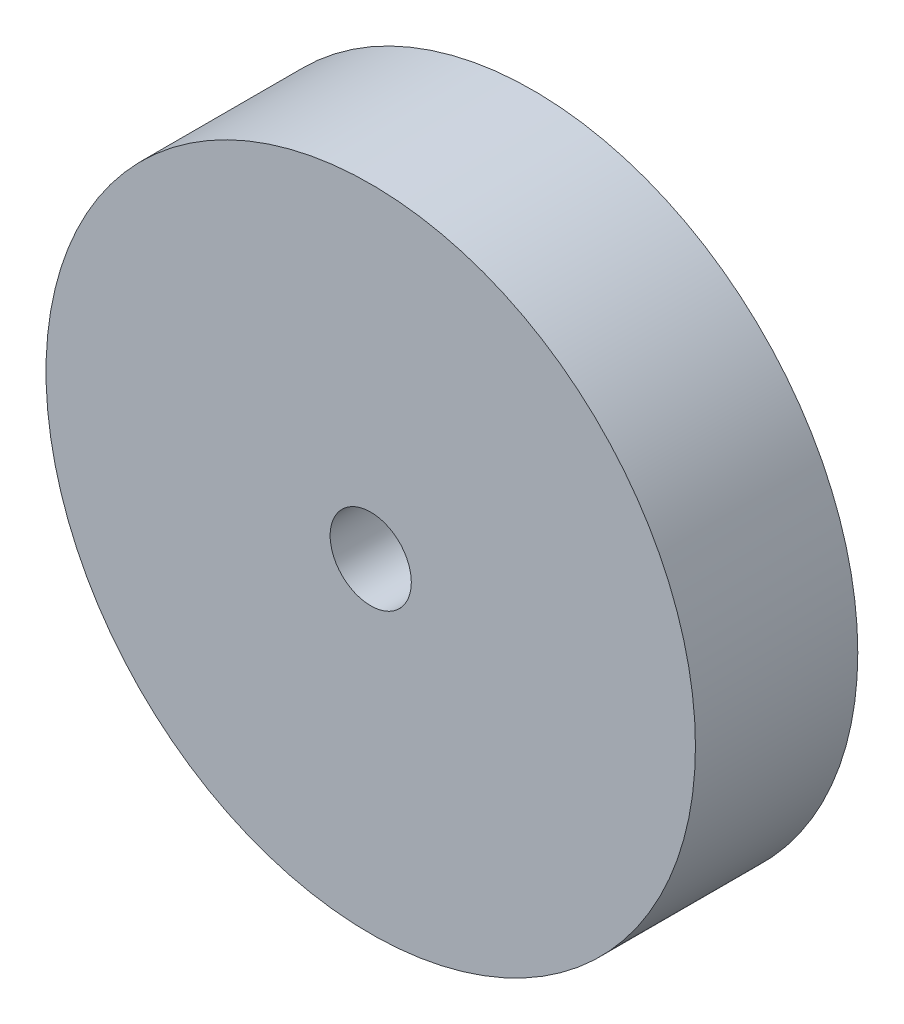
ISO-10303-21;
HEADER;
FILE_DESCRIPTION(('STEP AP214'),'2;1');
FILE_NAME('part.step','',(''),(''),'','','');
FILE_SCHEMA(('AUTOMOTIVE_DESIGN { 1 0 10303 214 1 1 1 1 }'));
ENDSEC;
DATA;
#1=APPLICATION_CONTEXT('core data for automotive mechanical design processes');
#2=APPLICATION_PROTOCOL_DEFINITION('international standard','automotive_design',2000,#1);
#3=PRODUCT_CONTEXT('',#1,'mechanical');
#4=PRODUCT('Part','Part','',(#3));
#5=PRODUCT_RELATED_PRODUCT_CATEGORY('part','',(#4));
#6=PRODUCT_DEFINITION_FORMATION('','',#4);
#7=PRODUCT_DEFINITION_CONTEXT('part definition',#1,'design');
#8=PRODUCT_DEFINITION('design','',#6,#7);
#9=PRODUCT_DEFINITION_SHAPE('','',#8);
#10=(LENGTH_UNIT() NAMED_UNIT(*) SI_UNIT(.MILLI.,.METRE.));
#11=(NAMED_UNIT(*) PLANE_ANGLE_UNIT() SI_UNIT($,.RADIAN.));
#12=(NAMED_UNIT(*) SI_UNIT($,.STERADIAN.) SOLID_ANGLE_UNIT());
#13=UNCERTAINTY_MEASURE_WITH_UNIT(LENGTH_MEASURE(1.E-05),#10,'distance_accuracy_value','');
#14=(GEOMETRIC_REPRESENTATION_CONTEXT(3) GLOBAL_UNCERTAINTY_ASSIGNED_CONTEXT((#13)) GLOBAL_UNIT_ASSIGNED_CONTEXT((#10,
#11,#12)) REPRESENTATION_CONTEXT('',''));
#15=CARTESIAN_POINT('',(0.,0.,0.));
#16=DIRECTION('',(0.,0.,1.));
#17=DIRECTION('',(1.,0.,0.));
#18=AXIS2_PLACEMENT_3D('',#15,#16,#17);
#19=CARTESIAN_POINT('',(0.,0.,-12.7));
#20=DIRECTION('',(0.,0.,1.));
#21=DIRECTION('',(1.,0.,0.));
#22=AXIS2_PLACEMENT_3D('',#19,#20,#21);
#23=CYLINDRICAL_SURFACE('',#22,50.8);
#24=CARTESIAN_POINT('',(0.,0.,-12.7));
#25=DIRECTION('',(0.,0.,1.));
#26=DIRECTION('',(1.,0.,0.));
#27=AXIS2_PLACEMENT_3D('',#24,#25,#26);
#28=CIRCLE('',#27,50.8);
#29=CARTESIAN_POINT('',(50.8,0.,-12.7));
#30=VERTEX_POINT('',#29);
#31=EDGE_CURVE('E10',#30,#30,#28,.T.);
#32=ORIENTED_EDGE('',*,*,#31,.T.);
#33=EDGE_LOOP('',(#32));
#34=FACE_BOUND('',#33,.T.);
#35=CARTESIAN_POINT('',(0.,0.,12.7));
#36=DIRECTION('',(0.,0.,1.));
#37=DIRECTION('',(1.,0.,0.));
#38=AXIS2_PLACEMENT_3D('',#35,#36,#37);
#39=CIRCLE('',#38,50.8);
#40=CARTESIAN_POINT('',(50.8,0.,12.7));
#41=VERTEX_POINT('',#40);
#42=EDGE_CURVE('E37',#41,#41,#39,.T.);
#43=ORIENTED_EDGE('',*,*,#42,.F.);
#44=EDGE_LOOP('',(#43));
#45=FACE_BOUND('',#44,.T.);
#46=ADVANCED_FACE('F34',(#34,#45),#23,.T.);
#47=CARTESIAN_POINT('',(0.,0.,-12.7));
#48=DIRECTION('',(0.,0.,1.));
#49=DIRECTION('',(1.,0.,0.));
#50=AXIS2_PLACEMENT_3D('',#47,#48,#49);
#51=PLANE('',#50);
#52=CARTESIAN_POINT('',(0.,0.,-12.7));
#53=DIRECTION('',(0.,0.,1.));
#54=DIRECTION('',(1.,0.,0.));
#55=AXIS2_PLACEMENT_3D('',#52,#53,#54);
#56=CIRCLE('',#55,6.35);
#57=CARTESIAN_POINT('',(6.35,0.,-12.7));
#58=VERTEX_POINT('',#57);
#59=EDGE_CURVE('E44',#58,#58,#56,.T.);
#60=ORIENTED_EDGE('',*,*,#59,.T.);
#61=EDGE_LOOP('',(#60));
#62=FACE_BOUND('',#61,.T.);
#63=ORIENTED_EDGE('',*,*,#31,.F.);
#64=EDGE_LOOP('',(#63));
#65=FACE_BOUND('',#64,.T.);
#66=ADVANCED_FACE('F52',(#62,#65),#51,.F.);
#67=CARTESIAN_POINT('',(0.,0.,12.7));
#68=DIRECTION('',(0.,0.,1.));
#69=DIRECTION('',(1.,0.,0.));
#70=AXIS2_PLACEMENT_3D('',#67,#68,#69);
#71=PLANE('',#70);
#72=CARTESIAN_POINT('',(0.,0.,12.7));
#73=DIRECTION('',(0.,0.,1.));
#74=DIRECTION('',(1.,0.,0.));
#75=AXIS2_PLACEMENT_3D('',#72,#73,#74);
#76=CIRCLE('',#75,6.35);
#77=CARTESIAN_POINT('',(6.35,0.,12.7));
#78=VERTEX_POINT('',#77);
#79=EDGE_CURVE('E46',#78,#78,#76,.T.);
#80=ORIENTED_EDGE('',*,*,#79,.F.);
#81=EDGE_LOOP('',(#80));
#82=FACE_BOUND('',#81,.T.);
#83=ORIENTED_EDGE('',*,*,#42,.T.);
#84=EDGE_LOOP('',(#83));
#85=FACE_BOUND('',#84,.T.);
#86=ADVANCED_FACE('F58',(#82,#85),#71,.T.);
#87=CARTESIAN_POINT('',(0.,0.,-12.7));
#88=DIRECTION('',(0.,0.,1.));
#89=DIRECTION('',(1.,0.,0.));
#90=AXIS2_PLACEMENT_3D('',#87,#88,#89);
#91=CYLINDRICAL_SURFACE('',#90,6.35);
#92=ORIENTED_EDGE('',*,*,#59,.F.);
#93=EDGE_LOOP('',(#92));
#94=FACE_BOUND('',#93,.T.);
#95=ORIENTED_EDGE('',*,*,#79,.T.);
#96=EDGE_LOOP('',(#95));
#97=FACE_BOUND('',#96,.T.);
#98=ADVANCED_FACE('F55',(#94,#97),#91,.F.);
#99=CLOSED_SHELL('',(#46,#66,#86,#98));
#100=MANIFOLD_SOLID_BREP('B2',#99);
#101=ADVANCED_BREP_SHAPE_REPRESENTATION('',(#18,#100),#14);
#102=SHAPE_DEFINITION_REPRESENTATION(#9,#101);
ENDSEC;
END-ISO-10303-21;
